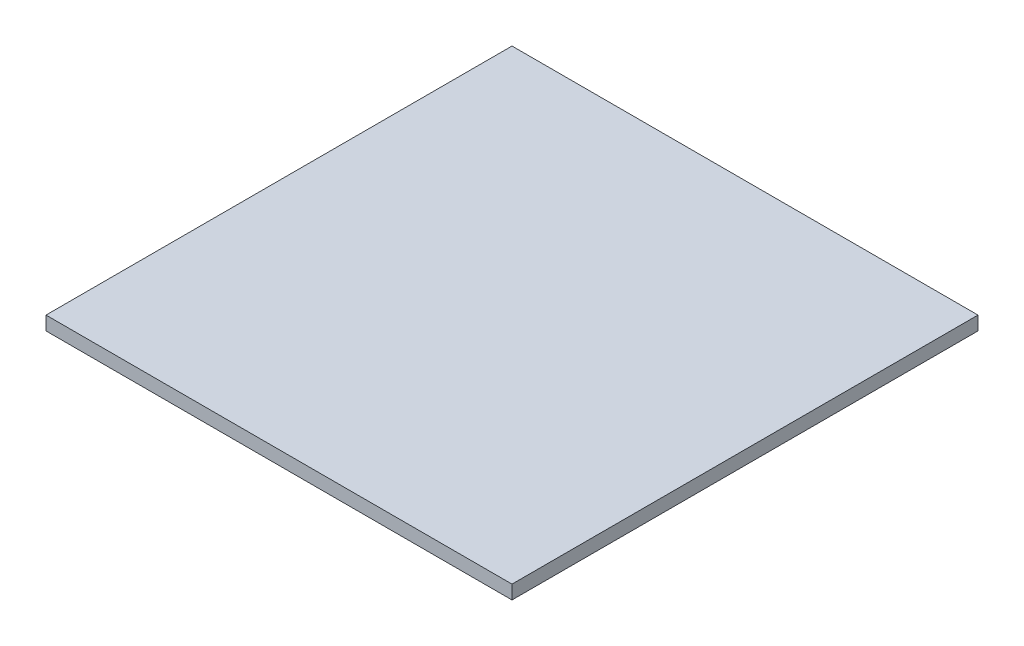
ISO-10303-21;
HEADER;
FILE_DESCRIPTION(('STEP AP214'),'2;1');
FILE_NAME('part.step','',(''),(''),'','','');
FILE_SCHEMA(('AUTOMOTIVE_DESIGN { 1 0 10303 214 1 1 1 1 }'));
ENDSEC;
DATA;
#1=APPLICATION_CONTEXT('core data for automotive mechanical design processes');
#2=APPLICATION_PROTOCOL_DEFINITION('international standard','automotive_design',2000,#1);
#3=PRODUCT_CONTEXT('',#1,'mechanical');
#4=PRODUCT('Part','Part','',(#3));
#5=PRODUCT_RELATED_PRODUCT_CATEGORY('part','',(#4));
#6=PRODUCT_DEFINITION_FORMATION('','',#4);
#7=PRODUCT_DEFINITION_CONTEXT('part definition',#1,'design');
#8=PRODUCT_DEFINITION('design','',#6,#7);
#9=PRODUCT_DEFINITION_SHAPE('','',#8);
#10=(LENGTH_UNIT() NAMED_UNIT(*) SI_UNIT(.MILLI.,.METRE.));
#11=(NAMED_UNIT(*) PLANE_ANGLE_UNIT() SI_UNIT($,.RADIAN.));
#12=(NAMED_UNIT(*) SI_UNIT($,.STERADIAN.) SOLID_ANGLE_UNIT());
#13=UNCERTAINTY_MEASURE_WITH_UNIT(LENGTH_MEASURE(1.E-05),#10,'distance_accuracy_value','');
#14=(GEOMETRIC_REPRESENTATION_CONTEXT(3) GLOBAL_UNCERTAINTY_ASSIGNED_CONTEXT((#13)) GLOBAL_UNIT_ASSIGNED_CONTEXT((#10,
#11,#12)) REPRESENTATION_CONTEXT('',''));
#15=CARTESIAN_POINT('',(0.,0.,0.));
#16=DIRECTION('',(0.,0.,1.));
#17=DIRECTION('',(1.,0.,0.));
#18=AXIS2_PLACEMENT_3D('',#15,#16,#17);
#19=CARTESIAN_POINT('',(25.4,1.5,25.4));
#20=DIRECTION('',(-1.,0.,0.));
#21=DIRECTION('',(0.,0.,1.));
#22=AXIS2_PLACEMENT_3D('',#19,#20,#21);
#23=PLANE('',#22);
#24=DIRECTION('',(0.,0.,-1.));
#25=VECTOR('',#24,1.);
#26=CARTESIAN_POINT('',(25.4,0.,25.4));
#27=LINE('',#26,#25);
#28=CARTESIAN_POINT('',(25.4,0.,25.4));
#29=VERTEX_POINT('',#28);
#30=CARTESIAN_POINT('',(25.4,0.,-25.4));
#31=VERTEX_POINT('',#30);
#32=EDGE_CURVE('E98',#29,#31,#27,.T.);
#33=ORIENTED_EDGE('',*,*,#32,.T.);
#34=DIRECTION('',(0.,-1.,0.));
#35=VECTOR('',#34,1.);
#36=CARTESIAN_POINT('',(25.4,1.5,-25.4));
#37=LINE('',#36,#35);
#38=CARTESIAN_POINT('',(25.4,1.5,-25.4));
#39=VERTEX_POINT('',#38);
#40=EDGE_CURVE('E11',#39,#31,#37,.T.);
#41=ORIENTED_EDGE('',*,*,#40,.F.);
#42=DIRECTION('',(0.,0.,-1.));
#43=VECTOR('',#42,1.);
#44=CARTESIAN_POINT('',(25.4,1.5,25.4));
#45=LINE('',#44,#43);
#46=CARTESIAN_POINT('',(25.4,1.5,25.4));
#47=VERTEX_POINT('',#46);
#48=EDGE_CURVE('E86',#47,#39,#45,.T.);
#49=ORIENTED_EDGE('',*,*,#48,.F.);
#50=DIRECTION('',(0.,-1.,0.));
#51=VECTOR('',#50,1.);
#52=CARTESIAN_POINT('',(25.4,1.5,25.4));
#53=LINE('',#52,#51);
#54=EDGE_CURVE('E94',#47,#29,#53,.T.);
#55=ORIENTED_EDGE('',*,*,#54,.T.);
#56=EDGE_LOOP('',(#33,#41,#49,#55));
#57=FACE_BOUND('',#56,.T.);
#58=ADVANCED_FACE('F35',(#57),#23,.F.);
#59=CARTESIAN_POINT('',(-25.4,1.5,-25.4));
#60=DIRECTION('',(0.,0.,1.));
#61=DIRECTION('',(1.,0.,0.));
#62=AXIS2_PLACEMENT_3D('',#59,#60,#61);
#63=PLANE('',#62);
#64=DIRECTION('',(-1.,0.,0.));
#65=VECTOR('',#64,1.);
#66=CARTESIAN_POINT('',(-25.4,0.,-25.4));
#67=LINE('',#66,#65);
#68=CARTESIAN_POINT('',(-25.4,0.,-25.4));
#69=VERTEX_POINT('',#68);
#70=EDGE_CURVE('E90',#31,#69,#67,.T.);
#71=ORIENTED_EDGE('',*,*,#70,.T.);
#72=DIRECTION('',(0.,-1.,0.));
#73=VECTOR('',#72,1.);
#74=CARTESIAN_POINT('',(-25.4,1.5,-25.4));
#75=LINE('',#74,#73);
#76=CARTESIAN_POINT('',(-25.4,1.5,-25.4));
#77=VERTEX_POINT('',#76);
#78=EDGE_CURVE('E43',#77,#69,#75,.T.);
#79=ORIENTED_EDGE('',*,*,#78,.F.);
#80=DIRECTION('',(-1.,0.,0.));
#81=VECTOR('',#80,1.);
#82=CARTESIAN_POINT('',(-25.4,1.5,-25.4));
#83=LINE('',#82,#81);
#84=EDGE_CURVE('E81',#39,#77,#83,.T.);
#85=ORIENTED_EDGE('',*,*,#84,.F.);
#86=ORIENTED_EDGE('',*,*,#40,.T.);
#87=EDGE_LOOP('',(#71,#79,#85,#86));
#88=FACE_BOUND('',#87,.T.);
#89=ADVANCED_FACE('F89',(#88),#63,.F.);
#90=CARTESIAN_POINT('',(-25.4,1.5,25.4));
#91=DIRECTION('',(1.,0.,0.));
#92=DIRECTION('',(0.,0.,-1.));
#93=AXIS2_PLACEMENT_3D('',#90,#91,#92);
#94=PLANE('',#93);
#95=DIRECTION('',(0.,0.,1.));
#96=VECTOR('',#95,1.);
#97=CARTESIAN_POINT('',(-25.4,0.,25.4));
#98=LINE('',#97,#96);
#99=CARTESIAN_POINT('',(-25.4,0.,25.4));
#100=VERTEX_POINT('',#99);
#101=EDGE_CURVE('E68',#69,#100,#98,.T.);
#102=ORIENTED_EDGE('',*,*,#101,.T.);
#103=DIRECTION('',(0.,-1.,0.));
#104=VECTOR('',#103,1.);
#105=CARTESIAN_POINT('',(-25.4,1.5,25.4));
#106=LINE('',#105,#104);
#107=CARTESIAN_POINT('',(-25.4,1.5,25.4));
#108=VERTEX_POINT('',#107);
#109=EDGE_CURVE('E91',#108,#100,#106,.T.);
#110=ORIENTED_EDGE('',*,*,#109,.F.);
#111=DIRECTION('',(0.,0.,1.));
#112=VECTOR('',#111,1.);
#113=CARTESIAN_POINT('',(-25.4,1.5,25.4));
#114=LINE('',#113,#112);
#115=EDGE_CURVE('E84',#77,#108,#114,.T.);
#116=ORIENTED_EDGE('',*,*,#115,.F.);
#117=ORIENTED_EDGE('',*,*,#78,.T.);
#118=EDGE_LOOP('',(#102,#110,#116,#117));
#119=FACE_BOUND('',#118,.T.);
#120=ADVANCED_FACE('F92',(#119),#94,.F.);
#121=CARTESIAN_POINT('',(-25.4,1.5,25.4));
#122=DIRECTION('',(0.,0.,-1.));
#123=DIRECTION('',(-1.,0.,0.));
#124=AXIS2_PLACEMENT_3D('',#121,#122,#123);
#125=PLANE('',#124);
#126=DIRECTION('',(1.,0.,0.));
#127=VECTOR('',#126,1.);
#128=CARTESIAN_POINT('',(-25.4,0.,25.4));
#129=LINE('',#128,#127);
#130=EDGE_CURVE('E74',#100,#29,#129,.T.);
#131=ORIENTED_EDGE('',*,*,#130,.T.);
#132=ORIENTED_EDGE('',*,*,#54,.F.);
#133=DIRECTION('',(1.,0.,0.));
#134=VECTOR('',#133,1.);
#135=CARTESIAN_POINT('',(-25.4,1.5,25.4));
#136=LINE('',#135,#134);
#137=EDGE_CURVE('E51',#108,#47,#136,.T.);
#138=ORIENTED_EDGE('',*,*,#137,.F.);
#139=ORIENTED_EDGE('',*,*,#109,.T.);
#140=EDGE_LOOP('',(#131,#132,#138,#139));
#141=FACE_BOUND('',#140,.T.);
#142=ADVANCED_FACE('F105',(#141),#125,.F.);
#143=CARTESIAN_POINT('',(0.,1.5,0.));
#144=DIRECTION('',(0.,-1.,0.));
#145=DIRECTION('',(0.,0.,-1.));
#146=AXIS2_PLACEMENT_3D('',#143,#144,#145);
#147=PLANE('',#146);
#148=ORIENTED_EDGE('',*,*,#48,.T.);
#149=ORIENTED_EDGE('',*,*,#84,.T.);
#150=ORIENTED_EDGE('',*,*,#115,.T.);
#151=ORIENTED_EDGE('',*,*,#137,.T.);
#152=EDGE_LOOP('',(#148,#149,#150,#151));
#153=FACE_BOUND('',#152,.T.);
#154=ADVANCED_FACE('F82',(#153),#147,.F.);
#155=CARTESIAN_POINT('',(0.,0.,0.));
#156=DIRECTION('',(0.,-1.,0.));
#157=DIRECTION('',(0.,0.,-1.));
#158=AXIS2_PLACEMENT_3D('',#155,#156,#157);
#159=PLANE('',#158);
#160=ORIENTED_EDGE('',*,*,#32,.F.);
#161=ORIENTED_EDGE('',*,*,#130,.F.);
#162=ORIENTED_EDGE('',*,*,#101,.F.);
#163=ORIENTED_EDGE('',*,*,#70,.F.);
#164=EDGE_LOOP('',(#160,#161,#162,#163));
#165=FACE_BOUND('',#164,.T.);
#166=ADVANCED_FACE('F108',(#165),#159,.T.);
#167=CLOSED_SHELL('',(#58,#89,#120,#142,#154,#166));
#168=MANIFOLD_SOLID_BREP('B2',#167);
#169=ADVANCED_BREP_SHAPE_REPRESENTATION('',(#18,#168),#14);
#170=SHAPE_DEFINITION_REPRESENTATION(#9,#169);
ENDSEC;
END-ISO-10303-21;
